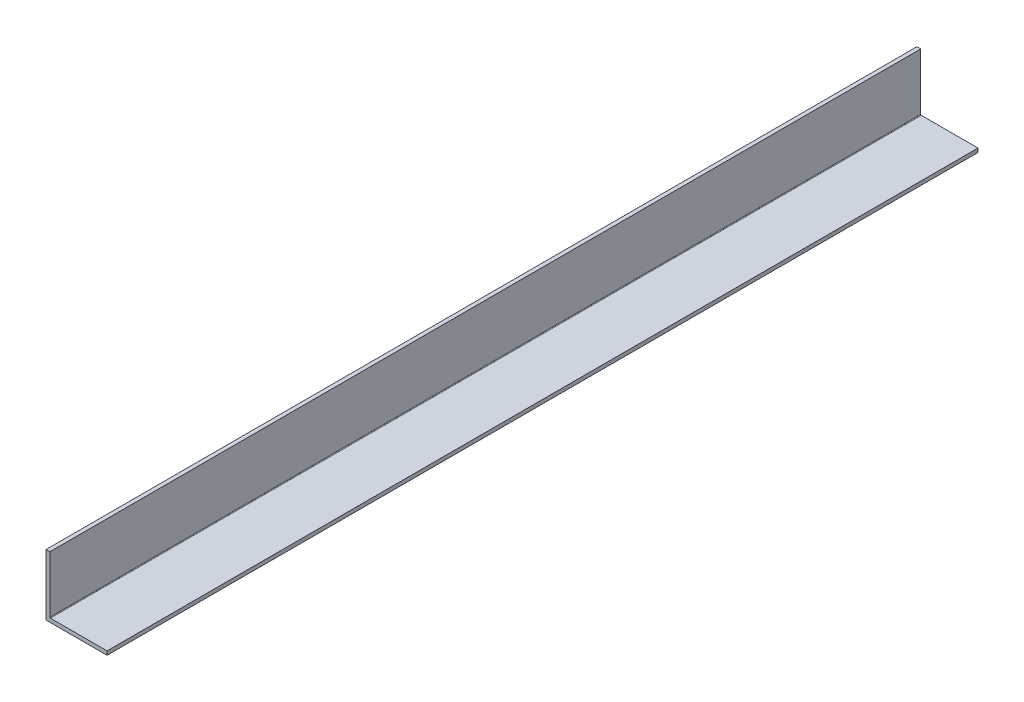
ISO-10303-21;
HEADER;
FILE_DESCRIPTION(('STEP AP214'),'2;1');
FILE_NAME('part.step','',(''),(''),'','','');
FILE_SCHEMA(('AUTOMOTIVE_DESIGN { 1 0 10303 214 1 1 1 1 }'));
ENDSEC;
DATA;
#1=APPLICATION_CONTEXT('core data for automotive mechanical design processes');
#2=APPLICATION_PROTOCOL_DEFINITION('international standard','automotive_design',2000,#1);
#3=PRODUCT_CONTEXT('',#1,'mechanical');
#4=PRODUCT('Part','Part','',(#3));
#5=PRODUCT_RELATED_PRODUCT_CATEGORY('part','',(#4));
#6=PRODUCT_DEFINITION_FORMATION('','',#4);
#7=PRODUCT_DEFINITION_CONTEXT('part definition',#1,'design');
#8=PRODUCT_DEFINITION('design','',#6,#7);
#9=PRODUCT_DEFINITION_SHAPE('','',#8);
#10=(LENGTH_UNIT() NAMED_UNIT(*) SI_UNIT(.MILLI.,.METRE.));
#11=(NAMED_UNIT(*) PLANE_ANGLE_UNIT() SI_UNIT($,.RADIAN.));
#12=(NAMED_UNIT(*) SI_UNIT($,.STERADIAN.) SOLID_ANGLE_UNIT());
#13=UNCERTAINTY_MEASURE_WITH_UNIT(LENGTH_MEASURE(1.E-05),#10,'distance_accuracy_value','');
#14=(GEOMETRIC_REPRESENTATION_CONTEXT(3) GLOBAL_UNCERTAINTY_ASSIGNED_CONTEXT((#13)) GLOBAL_UNIT_ASSIGNED_CONTEXT((#10,
#11,#12)) REPRESENTATION_CONTEXT('',''));
#15=CARTESIAN_POINT('',(0.,0.,0.));
#16=DIRECTION('',(0.,0.,1.));
#17=DIRECTION('',(1.,0.,0.));
#18=AXIS2_PLACEMENT_3D('',#15,#16,#17);
#19=CARTESIAN_POINT('',(1.5875,1.5875,304.8));
#20=DIRECTION('',(-1.,0.,0.));
#21=DIRECTION('',(0.,0.,1.));
#22=AXIS2_PLACEMENT_3D('',#19,#20,#21);
#23=PLANE('',#22);
#24=DIRECTION('',(0.,0.,-1.));
#25=VECTOR('',#24,1.);
#26=CARTESIAN_POINT('',(1.5875,1.8415,-304.8));
#27=LINE('',#26,#25);
#28=CARTESIAN_POINT('',(1.5875,1.8415,304.8));
#29=VERTEX_POINT('',#28);
#30=CARTESIAN_POINT('',(1.5875,1.8415,-57.45));
#31=VERTEX_POINT('',#30);
#32=EDGE_CURVE('E133',#29,#31,#27,.T.);
#33=ORIENTED_EDGE('',*,*,#32,.T.);
#34=DIRECTION('',(0.,-1.,0.));
#35=VECTOR('',#34,1.);
#36=CARTESIAN_POINT('',(1.5875,25.4,-57.45));
#37=LINE('',#36,#35);
#38=CARTESIAN_POINT('',(1.5875,25.4,-57.45));
#39=VERTEX_POINT('',#38);
#40=EDGE_CURVE('E60',#39,#31,#37,.T.);
#41=ORIENTED_EDGE('',*,*,#40,.F.);
#42=DIRECTION('',(0.,0.,-1.));
#43=VECTOR('',#42,1.);
#44=CARTESIAN_POINT('',(1.5875,25.4,304.8));
#45=LINE('',#44,#43);
#46=CARTESIAN_POINT('',(1.5875,25.4,304.8));
#47=VERTEX_POINT('',#46);
#48=EDGE_CURVE('E122',#47,#39,#45,.T.);
#49=ORIENTED_EDGE('',*,*,#48,.F.);
#50=DIRECTION('',(0.,1.,0.));
#51=VECTOR('',#50,1.);
#52=CARTESIAN_POINT('',(1.5875,1.5875,304.8));
#53=LINE('',#52,#51);
#54=EDGE_CURVE('E124',#29,#47,#53,.T.);
#55=ORIENTED_EDGE('',*,*,#54,.F.);
#56=EDGE_LOOP('',(#33,#41,#49,#55));
#57=FACE_BOUND('',#56,.T.);
#58=ADVANCED_FACE('F44',(#57),#23,.F.);
#59=CARTESIAN_POINT('',(1.5875,25.4,304.8));
#60=DIRECTION('',(0.,-1.,0.));
#61=DIRECTION('',(0.,0.,-1.));
#62=AXIS2_PLACEMENT_3D('',#59,#60,#61);
#63=PLANE('',#62);
#64=ORIENTED_EDGE('',*,*,#48,.T.);
#65=DIRECTION('',(1.,0.,0.));
#66=VECTOR('',#65,1.);
#67=CARTESIAN_POINT('',(0.,25.4,-57.45));
#68=LINE('',#67,#66);
#69=CARTESIAN_POINT('',(0.,25.4,-57.45));
#70=VERTEX_POINT('',#69);
#71=EDGE_CURVE('E105',#70,#39,#68,.T.);
#72=ORIENTED_EDGE('',*,*,#71,.F.);
#73=DIRECTION('',(0.,0.,-1.));
#74=VECTOR('',#73,1.);
#75=CARTESIAN_POINT('',(0.,25.4,304.8));
#76=LINE('',#75,#74);
#77=CARTESIAN_POINT('',(0.,25.4,304.8));
#78=VERTEX_POINT('',#77);
#79=EDGE_CURVE('E119',#78,#70,#76,.T.);
#80=ORIENTED_EDGE('',*,*,#79,.F.);
#81=DIRECTION('',(-1.,0.,0.));
#82=VECTOR('',#81,1.);
#83=CARTESIAN_POINT('',(1.5875,25.4,304.8));
#84=LINE('',#83,#82);
#85=EDGE_CURVE('E160',#47,#78,#84,.T.);
#86=ORIENTED_EDGE('',*,*,#85,.F.);
#87=EDGE_LOOP('',(#64,#72,#80,#86));
#88=FACE_BOUND('',#87,.T.);
#89=ADVANCED_FACE('F117',(#88),#63,.F.);
#90=CARTESIAN_POINT('',(0.,25.4,304.8));
#91=DIRECTION('',(1.,0.,0.));
#92=DIRECTION('',(0.,1.,0.));
#93=AXIS2_PLACEMENT_3D('',#90,#91,#92);
#94=PLANE('',#93);
#95=ORIENTED_EDGE('',*,*,#79,.T.);
#96=DIRECTION('',(0.,1.,0.));
#97=VECTOR('',#96,1.);
#98=CARTESIAN_POINT('',(0.,0.,-57.45));
#99=LINE('',#98,#97);
#100=CARTESIAN_POINT('',(0.,0.,-57.45));
#101=VERTEX_POINT('',#100);
#102=EDGE_CURVE('E102',#101,#70,#99,.T.);
#103=ORIENTED_EDGE('',*,*,#102,.F.);
#104=DIRECTION('',(0.,0.,-1.));
#105=VECTOR('',#104,1.);
#106=CARTESIAN_POINT('',(0.,0.,304.8));
#107=LINE('',#106,#105);
#108=CARTESIAN_POINT('',(0.,0.,304.8));
#109=VERTEX_POINT('',#108);
#110=EDGE_CURVE('E129',#109,#101,#107,.T.);
#111=ORIENTED_EDGE('',*,*,#110,.F.);
#112=DIRECTION('',(0.,-1.,0.));
#113=VECTOR('',#112,1.);
#114=CARTESIAN_POINT('',(0.,25.4,304.8));
#115=LINE('',#114,#113);
#116=EDGE_CURVE('E127',#78,#109,#115,.T.);
#117=ORIENTED_EDGE('',*,*,#116,.F.);
#118=EDGE_LOOP('',(#95,#103,#111,#117));
#119=FACE_BOUND('',#118,.T.);
#120=ADVANCED_FACE('F126',(#119),#94,.F.);
#121=CARTESIAN_POINT('',(0.,0.,304.8));
#122=DIRECTION('',(0.,1.,0.));
#123=DIRECTION('',(0.,0.,1.));
#124=AXIS2_PLACEMENT_3D('',#121,#122,#123);
#125=PLANE('',#124);
#126=ORIENTED_EDGE('',*,*,#110,.T.);
#127=DIRECTION('',(-1.,0.,0.));
#128=VECTOR('',#127,1.);
#129=CARTESIAN_POINT('',(25.4,0.,-57.45));
#130=LINE('',#129,#128);
#131=CARTESIAN_POINT('',(25.4,0.,-57.45));
#132=VERTEX_POINT('',#131);
#133=EDGE_CURVE('E107',#132,#101,#130,.T.);
#134=ORIENTED_EDGE('',*,*,#133,.F.);
#135=DIRECTION('',(0.,0.,-1.));
#136=VECTOR('',#135,1.);
#137=CARTESIAN_POINT('',(25.4,0.,304.8));
#138=LINE('',#137,#136);
#139=CARTESIAN_POINT('',(25.4,0.,304.8));
#140=VERTEX_POINT('',#139);
#141=EDGE_CURVE('E135',#140,#132,#138,.T.);
#142=ORIENTED_EDGE('',*,*,#141,.F.);
#143=DIRECTION('',(1.,0.,0.));
#144=VECTOR('',#143,1.);
#145=CARTESIAN_POINT('',(0.,0.,304.8));
#146=LINE('',#145,#144);
#147=EDGE_CURVE('E165',#109,#140,#146,.T.);
#148=ORIENTED_EDGE('',*,*,#147,.F.);
#149=EDGE_LOOP('',(#126,#134,#142,#148));
#150=FACE_BOUND('',#149,.T.);
#151=ADVANCED_FACE('F187',(#150),#125,.F.);
#152=CARTESIAN_POINT('',(25.4,0.,304.8));
#153=DIRECTION('',(-1.,0.,0.));
#154=DIRECTION('',(0.,0.,1.));
#155=AXIS2_PLACEMENT_3D('',#152,#153,#154);
#156=PLANE('',#155);
#157=ORIENTED_EDGE('',*,*,#141,.T.);
#158=DIRECTION('',(0.,-1.,0.));
#159=VECTOR('',#158,1.);
#160=CARTESIAN_POINT('',(25.4,1.5875,-57.45));
#161=LINE('',#160,#159);
#162=CARTESIAN_POINT('',(25.4,1.5875,-57.45));
#163=VERTEX_POINT('',#162);
#164=EDGE_CURVE('E153',#163,#132,#161,.T.);
#165=ORIENTED_EDGE('',*,*,#164,.F.);
#166=DIRECTION('',(0.,0.,-1.));
#167=VECTOR('',#166,1.);
#168=CARTESIAN_POINT('',(25.4,1.5875,304.8));
#169=LINE('',#168,#167);
#170=CARTESIAN_POINT('',(25.4,1.5875,304.8));
#171=VERTEX_POINT('',#170);
#172=EDGE_CURVE('E174',#171,#163,#169,.T.);
#173=ORIENTED_EDGE('',*,*,#172,.F.);
#174=DIRECTION('',(0.,1.,0.));
#175=VECTOR('',#174,1.);
#176=CARTESIAN_POINT('',(25.4,0.,304.8));
#177=LINE('',#176,#175);
#178=EDGE_CURVE('E168',#140,#171,#177,.T.);
#179=ORIENTED_EDGE('',*,*,#178,.F.);
#180=EDGE_LOOP('',(#157,#165,#173,#179));
#181=FACE_BOUND('',#180,.T.);
#182=ADVANCED_FACE('F183',(#181),#156,.F.);
#183=CARTESIAN_POINT('',(25.4,1.5875,304.8));
#184=DIRECTION('',(0.,-1.,0.));
#185=DIRECTION('',(1.,0.,0.));
#186=AXIS2_PLACEMENT_3D('',#183,#184,#185);
#187=PLANE('',#186);
#188=ORIENTED_EDGE('',*,*,#172,.T.);
#189=DIRECTION('',(1.,0.,0.));
#190=VECTOR('',#189,1.);
#191=CARTESIAN_POINT('',(1.8415,1.5875,-57.45));
#192=LINE('',#191,#190);
#193=CARTESIAN_POINT('',(1.8415,1.5875,-57.45));
#194=VERTEX_POINT('',#193);
#195=EDGE_CURVE('E149',#194,#163,#192,.T.);
#196=ORIENTED_EDGE('',*,*,#195,.F.);
#197=DIRECTION('',(0.,0.,-1.));
#198=VECTOR('',#197,1.);
#199=CARTESIAN_POINT('',(1.8415,1.5875,304.8));
#200=LINE('',#199,#198);
#201=CARTESIAN_POINT('',(1.8415,1.5875,304.8));
#202=VERTEX_POINT('',#201);
#203=EDGE_CURVE('E53',#194,#202,#200,.F.);
#204=ORIENTED_EDGE('',*,*,#203,.T.);
#205=DIRECTION('',(-1.,0.,0.));
#206=VECTOR('',#205,1.);
#207=CARTESIAN_POINT('',(25.4,1.5875,304.8));
#208=LINE('',#207,#206);
#209=EDGE_CURVE('E171',#171,#202,#208,.T.);
#210=ORIENTED_EDGE('',*,*,#209,.F.);
#211=EDGE_LOOP('',(#188,#196,#204,#210));
#212=FACE_BOUND('',#211,.T.);
#213=ADVANCED_FACE('F191',(#212),#187,.F.);
#214=CARTESIAN_POINT('',(0.,0.,304.8));
#215=DIRECTION('',(0.,0.,1.));
#216=DIRECTION('',(1.,0.,0.));
#217=AXIS2_PLACEMENT_3D('',#214,#215,#216);
#218=PLANE('',#217);
#219=ORIENTED_EDGE('',*,*,#209,.T.);
#220=CARTESIAN_POINT('',(1.8415,1.8415,304.8));
#221=DIRECTION('',(0.,0.,1.));
#222=DIRECTION('',(1.,0.,0.));
#223=AXIS2_PLACEMENT_3D('',#220,#221,#222);
#224=CIRCLE('',#223,0.254);
#225=EDGE_CURVE('E12',#202,#29,#224,.F.);
#226=ORIENTED_EDGE('',*,*,#225,.T.);
#227=ORIENTED_EDGE('',*,*,#54,.T.);
#228=ORIENTED_EDGE('',*,*,#85,.T.);
#229=ORIENTED_EDGE('',*,*,#116,.T.);
#230=ORIENTED_EDGE('',*,*,#147,.T.);
#231=ORIENTED_EDGE('',*,*,#178,.T.);
#232=EDGE_LOOP('',(#219,#226,#227,#228,#229,#230,#231));
#233=FACE_BOUND('',#232,.T.);
#234=ADVANCED_FACE('F193',(#233),#218,.T.);
#235=CARTESIAN_POINT('',(1.8415,1.8415,304.8));
#236=DIRECTION('',(0.,0.,1.));
#237=DIRECTION('',(1.,0.,0.));
#238=AXIS2_PLACEMENT_3D('',#235,#236,#237);
#239=CYLINDRICAL_SURFACE('',#238,0.254);
#240=ORIENTED_EDGE('',*,*,#203,.F.);
#241=CARTESIAN_POINT('',(1.8415,1.8415,-57.45));
#242=DIRECTION('',(0.,0.,1.));
#243=DIRECTION('',(1.,0.,0.));
#244=AXIS2_PLACEMENT_3D('',#241,#242,#243);
#245=CIRCLE('',#244,0.254);
#246=EDGE_CURVE('E147',#31,#194,#245,.T.);
#247=ORIENTED_EDGE('',*,*,#246,.F.);
#248=ORIENTED_EDGE('',*,*,#32,.F.);
#249=ORIENTED_EDGE('',*,*,#225,.F.);
#250=EDGE_LOOP('',(#240,#247,#248,#249));
#251=FACE_BOUND('',#250,.T.);
#252=ADVANCED_FACE('F46',(#251),#239,.F.);
#253=CARTESIAN_POINT('',(0.,0.,-57.45));
#254=DIRECTION('',(0.,0.,1.));
#255=DIRECTION('',(1.,0.,0.));
#256=AXIS2_PLACEMENT_3D('',#253,#254,#255);
#257=PLANE('',#256);
#258=ORIENTED_EDGE('',*,*,#71,.T.);
#259=ORIENTED_EDGE('',*,*,#40,.T.);
#260=ORIENTED_EDGE('',*,*,#246,.T.);
#261=ORIENTED_EDGE('',*,*,#195,.T.);
#262=ORIENTED_EDGE('',*,*,#164,.T.);
#263=ORIENTED_EDGE('',*,*,#133,.T.);
#264=ORIENTED_EDGE('',*,*,#102,.T.);
#265=EDGE_LOOP('',(#258,#259,#260,#261,#262,#263,#264));
#266=FACE_BOUND('',#265,.T.);
#267=ADVANCED_FACE('F104',(#266),#257,.F.);
#268=CLOSED_SHELL('',(#58,#89,#120,#151,#182,#213,#234,#252,#267));
#269=MANIFOLD_SOLID_BREP('B2',#268);
#270=ADVANCED_BREP_SHAPE_REPRESENTATION('',(#18,#269),#14);
#271=SHAPE_DEFINITION_REPRESENTATION(#9,#270);
ENDSEC;
END-ISO-10303-21;
